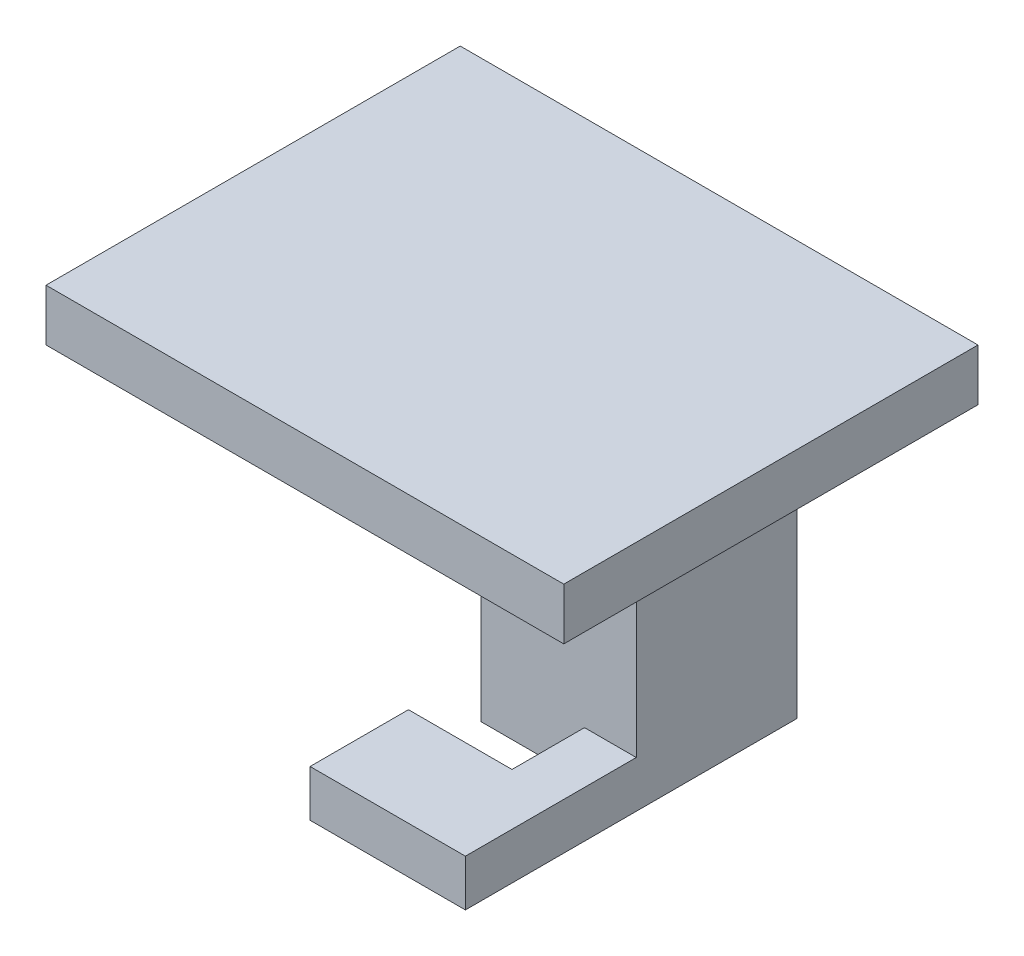
ISO-10303-21;
HEADER;
FILE_DESCRIPTION(('STEP AP214'),'2;1');
FILE_NAME('part.step','',(''),(''),'','','');
FILE_SCHEMA(('AUTOMOTIVE_DESIGN { 1 0 10303 214 1 1 1 1 }'));
ENDSEC;
DATA;
#1=APPLICATION_CONTEXT('core data for automotive mechanical design processes');
#2=APPLICATION_PROTOCOL_DEFINITION('international standard','automotive_design',2000,#1);
#3=PRODUCT_CONTEXT('',#1,'mechanical');
#4=PRODUCT('Part','Part','',(#3));
#5=PRODUCT_RELATED_PRODUCT_CATEGORY('part','',(#4));
#6=PRODUCT_DEFINITION_FORMATION('','',#4);
#7=PRODUCT_DEFINITION_CONTEXT('part definition',#1,'design');
#8=PRODUCT_DEFINITION('design','',#6,#7);
#9=PRODUCT_DEFINITION_SHAPE('','',#8);
#10=(LENGTH_UNIT() NAMED_UNIT(*) SI_UNIT(.MILLI.,.METRE.));
#11=(NAMED_UNIT(*) PLANE_ANGLE_UNIT() SI_UNIT($,.RADIAN.));
#12=(NAMED_UNIT(*) SI_UNIT($,.STERADIAN.) SOLID_ANGLE_UNIT());
#13=UNCERTAINTY_MEASURE_WITH_UNIT(LENGTH_MEASURE(1.E-05),#10,'distance_accuracy_value','');
#14=(GEOMETRIC_REPRESENTATION_CONTEXT(3) GLOBAL_UNCERTAINTY_ASSIGNED_CONTEXT((#13)) GLOBAL_UNIT_ASSIGNED_CONTEXT((#10,
#11,#12)) REPRESENTATION_CONTEXT('',''));
#15=CARTESIAN_POINT('',(0.,0.,0.));
#16=DIRECTION('',(0.,0.,1.));
#17=DIRECTION('',(1.,0.,0.));
#18=AXIS2_PLACEMENT_3D('',#15,#16,#17);
#19=CARTESIAN_POINT('',(-7.5,17.5,32.));
#20=DIRECTION('',(1.,0.,0.));
#21=DIRECTION('',(0.,1.,0.));
#22=AXIS2_PLACEMENT_3D('',#19,#20,#21);
#23=PLANE('',#22);
#24=DIRECTION('',(0.,0.,-1.));
#25=VECTOR('',#24,1.);
#26=CARTESIAN_POINT('',(-7.5,-17.5,32.));
#27=LINE('',#26,#25);
#28=CARTESIAN_POINT('',(-7.5,-17.5,15.5));
#29=VERTEX_POINT('',#28);
#30=CARTESIAN_POINT('',(-7.5,-17.5,0.));
#31=VERTEX_POINT('',#30);
#32=EDGE_CURVE('E258',#29,#31,#27,.T.);
#33=ORIENTED_EDGE('',*,*,#32,.F.);
#34=DIRECTION('',(0.,-1.,0.));
#35=VECTOR('',#34,1.);
#36=CARTESIAN_POINT('',(-7.5,0.,15.5));
#37=LINE('',#36,#35);
#38=CARTESIAN_POINT('',(-7.5,9.99999999999999,15.5));
#39=VERTEX_POINT('',#38);
#40=EDGE_CURVE('E152',#39,#29,#37,.T.);
#41=ORIENTED_EDGE('',*,*,#40,.F.);
#42=DIRECTION('',(0.,0.,1.));
#43=VECTOR('',#42,1.);
#44=CARTESIAN_POINT('',(-7.5,9.99999999999999,15.5));
#45=LINE('',#44,#43);
#46=CARTESIAN_POINT('',(-7.5,9.99999999999999,32.));
#47=VERTEX_POINT('',#46);
#48=EDGE_CURVE('E223',#39,#47,#45,.T.);
#49=ORIENTED_EDGE('',*,*,#48,.T.);
#50=DIRECTION('',(0.,-1.,0.));
#51=VECTOR('',#50,1.);
#52=CARTESIAN_POINT('',(-7.5,17.5,32.));
#53=LINE('',#52,#51);
#54=CARTESIAN_POINT('',(-7.5,17.5,32.));
#55=VERTEX_POINT('',#54);
#56=EDGE_CURVE('E233',#55,#47,#53,.T.);
#57=ORIENTED_EDGE('',*,*,#56,.F.);
#58=DIRECTION('',(0.,0.,-1.));
#59=VECTOR('',#58,1.);
#60=CARTESIAN_POINT('',(-7.5,17.5,32.));
#61=LINE('',#60,#59);
#62=CARTESIAN_POINT('',(-7.5,17.5,0.));
#63=VERTEX_POINT('',#62);
#64=EDGE_CURVE('E245',#55,#63,#61,.T.);
#65=ORIENTED_EDGE('',*,*,#64,.T.);
#66=DIRECTION('',(0.,-1.,0.));
#67=VECTOR('',#66,1.);
#68=CARTESIAN_POINT('',(-7.5,17.5,0.));
#69=LINE('',#68,#67);
#70=EDGE_CURVE('E226',#63,#31,#69,.T.);
#71=ORIENTED_EDGE('',*,*,#70,.T.);
#72=EDGE_LOOP('',(#33,#41,#49,#57,#65,#71));
#73=FACE_BOUND('',#72,.T.);
#74=ADVANCED_FACE('F37',(#73),#23,.F.);
#75=DIRECTION('',(0.,0.,1.));
#76=VECTOR('',#75,1.);
#77=CARTESIAN_POINT('',(-7.5,-13.,15.5));
#78=LINE('',#77,#76);
#79=CARTESIAN_POINT('',(-7.5,-13.,22.5));
#80=VERTEX_POINT('',#79);
#81=CARTESIAN_POINT('',(-7.5,-13.,32.));
#82=VERTEX_POINT('',#81);
#83=EDGE_CURVE('E60',#80,#82,#78,.T.);
#84=ORIENTED_EDGE('',*,*,#83,.F.);
#85=DIRECTION('',(0.,1.,0.));
#86=VECTOR('',#85,1.);
#87=CARTESIAN_POINT('',(-7.5,-17.5,22.5));
#88=LINE('',#87,#86);
#89=CARTESIAN_POINT('',(-7.5,-17.5,22.5));
#90=VERTEX_POINT('',#89);
#91=EDGE_CURVE('E162',#90,#80,#88,.T.);
#92=ORIENTED_EDGE('',*,*,#91,.F.);
#93=CARTESIAN_POINT('',(-7.5,-17.5,32.));
#94=VERTEX_POINT('',#93);
#95=EDGE_CURVE('E45',#94,#90,#27,.T.);
#96=ORIENTED_EDGE('',*,*,#95,.F.);
#97=EDGE_CURVE('E237',#82,#94,#53,.T.);
#98=ORIENTED_EDGE('',*,*,#97,.F.);
#99=EDGE_LOOP('',(#84,#92,#96,#98));
#100=FACE_BOUND('',#99,.T.);
#101=ADVANCED_FACE('F39',(#100),#23,.F.);
#102=CARTESIAN_POINT('',(7.5,17.5,32.));
#103=DIRECTION('',(-1.,0.,0.));
#104=DIRECTION('',(0.,-1.,0.));
#105=AXIS2_PLACEMENT_3D('',#102,#103,#104);
#106=PLANE('',#105);
#107=DIRECTION('',(0.,0.,1.));
#108=VECTOR('',#107,1.);
#109=CARTESIAN_POINT('',(7.5,9.99999999999999,15.5));
#110=LINE('',#109,#108);
#111=CARTESIAN_POINT('',(7.5,9.99999999999999,15.5));
#112=VERTEX_POINT('',#111);
#113=CARTESIAN_POINT('',(7.5,9.99999999999999,32.));
#114=VERTEX_POINT('',#113);
#115=EDGE_CURVE('E227',#112,#114,#110,.T.);
#116=ORIENTED_EDGE('',*,*,#115,.F.);
#117=DIRECTION('',(0.,1.,0.));
#118=VECTOR('',#117,1.);
#119=CARTESIAN_POINT('',(7.5,0.,15.5));
#120=LINE('',#119,#118);
#121=CARTESIAN_POINT('',(7.5,-13.,15.5));
#122=VERTEX_POINT('',#121);
#123=EDGE_CURVE('E215',#122,#112,#120,.T.);
#124=ORIENTED_EDGE('',*,*,#123,.F.);
#125=DIRECTION('',(0.,0.,1.));
#126=VECTOR('',#125,1.);
#127=CARTESIAN_POINT('',(7.5,-13.,15.5));
#128=LINE('',#127,#126);
#129=CARTESIAN_POINT('',(7.5,-13.,32.));
#130=VERTEX_POINT('',#129);
#131=EDGE_CURVE('E229',#122,#130,#128,.T.);
#132=ORIENTED_EDGE('',*,*,#131,.T.);
#133=DIRECTION('',(0.,1.,0.));
#134=VECTOR('',#133,1.);
#135=CARTESIAN_POINT('',(7.5,17.5,32.));
#136=LINE('',#135,#134);
#137=CARTESIAN_POINT('',(7.5,-17.5,32.));
#138=VERTEX_POINT('',#137);
#139=EDGE_CURVE('E240',#138,#130,#136,.T.);
#140=ORIENTED_EDGE('',*,*,#139,.F.);
#141=DIRECTION('',(0.,0.,-1.));
#142=VECTOR('',#141,1.);
#143=CARTESIAN_POINT('',(7.5,-17.5,32.));
#144=LINE('',#143,#142);
#145=CARTESIAN_POINT('',(7.5,-17.5,0.));
#146=VERTEX_POINT('',#145);
#147=EDGE_CURVE('E256',#138,#146,#144,.T.);
#148=ORIENTED_EDGE('',*,*,#147,.T.);
#149=DIRECTION('',(0.,1.,0.));
#150=VECTOR('',#149,1.);
#151=CARTESIAN_POINT('',(7.5,17.5,0.));
#152=LINE('',#151,#150);
#153=CARTESIAN_POINT('',(7.5,17.5,0.));
#154=VERTEX_POINT('',#153);
#155=EDGE_CURVE('E250',#146,#154,#152,.T.);
#156=ORIENTED_EDGE('',*,*,#155,.T.);
#157=DIRECTION('',(0.,0.,-1.));
#158=VECTOR('',#157,1.);
#159=CARTESIAN_POINT('',(7.5,17.5,32.));
#160=LINE('',#159,#158);
#161=CARTESIAN_POINT('',(7.5,17.5,32.));
#162=VERTEX_POINT('',#161);
#163=EDGE_CURVE('E253',#162,#154,#160,.T.);
#164=ORIENTED_EDGE('',*,*,#163,.F.);
#165=EDGE_CURVE('E239',#114,#162,#136,.T.);
#166=ORIENTED_EDGE('',*,*,#165,.F.);
#167=EDGE_LOOP('',(#116,#124,#132,#140,#148,#156,#164,#166));
#168=FACE_BOUND('',#167,.T.);
#169=ADVANCED_FACE('F293',(#168),#106,.F.);
#170=CARTESIAN_POINT('',(0.,0.,32.));
#171=DIRECTION('',(0.,0.,1.));
#172=DIRECTION('',(1.,0.,0.));
#173=AXIS2_PLACEMENT_3D('',#170,#171,#172);
#174=PLANE('',#173);
#175=ORIENTED_EDGE('',*,*,#56,.T.);
#176=DIRECTION('',(1.,0.,0.));
#177=VECTOR('',#176,1.);
#178=CARTESIAN_POINT('',(0.,9.99999999999999,32.));
#179=LINE('',#178,#177);
#180=EDGE_CURVE('E213',#47,#114,#179,.T.);
#181=ORIENTED_EDGE('',*,*,#180,.T.);
#182=ORIENTED_EDGE('',*,*,#165,.T.);
#183=DIRECTION('',(-1.,0.,0.));
#184=VECTOR('',#183,1.);
#185=CARTESIAN_POINT('',(-7.5,17.5,32.));
#186=LINE('',#185,#184);
#187=EDGE_CURVE('E243',#162,#55,#186,.T.);
#188=ORIENTED_EDGE('',*,*,#187,.T.);
#189=EDGE_LOOP('',(#175,#181,#182,#188));
#190=FACE_BOUND('',#189,.T.);
#191=ADVANCED_FACE('F307',(#190),#174,.T.);
#192=CARTESIAN_POINT('',(-7.5,-17.5,32.));
#193=DIRECTION('',(0.,1.,0.));
#194=DIRECTION('',(0.,0.,1.));
#195=AXIS2_PLACEMENT_3D('',#192,#193,#194);
#196=PLANE('',#195);
#197=DIRECTION('',(0.,0.,1.));
#198=VECTOR('',#197,1.);
#199=CARTESIAN_POINT('',(2.5,-17.5,15.5));
#200=LINE('',#199,#198);
#201=CARTESIAN_POINT('',(2.5,-17.5,15.5));
#202=VERTEX_POINT('',#201);
#203=CARTESIAN_POINT('',(2.5,-17.5,22.5));
#204=VERTEX_POINT('',#203);
#205=EDGE_CURVE('E160',#202,#204,#200,.T.);
#206=ORIENTED_EDGE('',*,*,#205,.F.);
#207=DIRECTION('',(-1.,0.,0.));
#208=VECTOR('',#207,1.);
#209=CARTESIAN_POINT('',(2.5,-17.5,15.5));
#210=LINE('',#209,#208);
#211=EDGE_CURVE('E146',#202,#29,#210,.T.);
#212=ORIENTED_EDGE('',*,*,#211,.T.);
#213=ORIENTED_EDGE('',*,*,#32,.T.);
#214=DIRECTION('',(1.,0.,0.));
#215=VECTOR('',#214,1.);
#216=CARTESIAN_POINT('',(-7.5,-17.5,0.));
#217=LINE('',#216,#215);
#218=EDGE_CURVE('E248',#31,#146,#217,.T.);
#219=ORIENTED_EDGE('',*,*,#218,.T.);
#220=ORIENTED_EDGE('',*,*,#147,.F.);
#221=DIRECTION('',(1.,0.,0.));
#222=VECTOR('',#221,1.);
#223=CARTESIAN_POINT('',(-7.5,-17.5,32.));
#224=LINE('',#223,#222);
#225=EDGE_CURVE('E236',#94,#138,#224,.T.);
#226=ORIENTED_EDGE('',*,*,#225,.F.);
#227=ORIENTED_EDGE('',*,*,#95,.T.);
#228=DIRECTION('',(-1.,0.,0.));
#229=VECTOR('',#228,1.);
#230=CARTESIAN_POINT('',(2.5,-17.5,22.5));
#231=LINE('',#230,#229);
#232=EDGE_CURVE('E156',#204,#90,#231,.T.);
#233=ORIENTED_EDGE('',*,*,#232,.F.);
#234=EDGE_LOOP('',(#206,#212,#213,#219,#220,#226,#227,#233));
#235=FACE_BOUND('',#234,.T.);
#236=ADVANCED_FACE('F164',(#235),#196,.F.);
#237=DIRECTION('',(1.,0.,0.));
#238=VECTOR('',#237,1.);
#239=CARTESIAN_POINT('',(0.,-13.,32.));
#240=LINE('',#239,#238);
#241=EDGE_CURVE('E210',#82,#130,#240,.T.);
#242=ORIENTED_EDGE('',*,*,#241,.F.);
#243=ORIENTED_EDGE('',*,*,#97,.T.);
#244=ORIENTED_EDGE('',*,*,#225,.T.);
#245=ORIENTED_EDGE('',*,*,#139,.T.);
#246=EDGE_LOOP('',(#242,#243,#244,#245));
#247=FACE_BOUND('',#246,.T.);
#248=ADVANCED_FACE('F310',(#247),#174,.T.);
#249=CARTESIAN_POINT('',(0.,0.,0.));
#250=DIRECTION('',(0.,0.,1.));
#251=DIRECTION('',(1.,0.,0.));
#252=AXIS2_PLACEMENT_3D('',#249,#250,#251);
#253=PLANE('',#252);
#254=CARTESIAN_POINT('',(0.,-6.4,0.));
#255=DIRECTION('',(0.,0.,1.));
#256=DIRECTION('',(1.,0.,0.));
#257=AXIS2_PLACEMENT_3D('',#254,#255,#256);
#258=CIRCLE('',#257,2.5);
#259=CARTESIAN_POINT('',(2.5,-6.4,0.));
#260=VERTEX_POINT('',#259);
#261=EDGE_CURVE('E11',#260,#260,#258,.F.);
#262=ORIENTED_EDGE('',*,*,#261,.F.);
#263=EDGE_LOOP('',(#262));
#264=FACE_BOUND('',#263,.T.);
#265=ORIENTED_EDGE('',*,*,#70,.F.);
#266=DIRECTION('',(-1.,0.,0.));
#267=VECTOR('',#266,1.);
#268=CARTESIAN_POINT('',(-25.,17.5,0.));
#269=LINE('',#268,#267);
#270=CARTESIAN_POINT('',(-25.,17.5,0.));
#271=VERTEX_POINT('',#270);
#272=EDGE_CURVE('E193',#63,#271,#269,.T.);
#273=ORIENTED_EDGE('',*,*,#272,.T.);
#274=DIRECTION('',(0.,-1.,0.));
#275=VECTOR('',#274,1.);
#276=CARTESIAN_POINT('',(-25.,22.5,0.));
#277=LINE('',#276,#275);
#278=CARTESIAN_POINT('',(-25.,22.5,0.));
#279=VERTEX_POINT('',#278);
#280=EDGE_CURVE('E186',#279,#271,#277,.T.);
#281=ORIENTED_EDGE('',*,*,#280,.F.);
#282=DIRECTION('',(-1.,0.,0.));
#283=VECTOR('',#282,1.);
#284=CARTESIAN_POINT('',(-25.,22.5,0.));
#285=LINE('',#284,#283);
#286=CARTESIAN_POINT('',(25.,22.5,0.));
#287=VERTEX_POINT('',#286);
#288=EDGE_CURVE('E184',#287,#279,#285,.T.);
#289=ORIENTED_EDGE('',*,*,#288,.F.);
#290=DIRECTION('',(0.,-1.,0.));
#291=VECTOR('',#290,1.);
#292=CARTESIAN_POINT('',(25.,22.5,0.));
#293=LINE('',#292,#291);
#294=CARTESIAN_POINT('',(25.,17.5,0.));
#295=VERTEX_POINT('',#294);
#296=EDGE_CURVE('E198',#287,#295,#293,.T.);
#297=ORIENTED_EDGE('',*,*,#296,.T.);
#298=EDGE_CURVE('E180',#295,#154,#269,.T.);
#299=ORIENTED_EDGE('',*,*,#298,.T.);
#300=ORIENTED_EDGE('',*,*,#155,.F.);
#301=ORIENTED_EDGE('',*,*,#218,.F.);
#302=EDGE_LOOP('',(#265,#273,#281,#289,#297,#299,#300,#301));
#303=FACE_BOUND('',#302,.T.);
#304=ADVANCED_FACE('F267',(#264,#303),#253,.F.);
#305=CARTESIAN_POINT('',(0.,9.99999999999999,15.5));
#306=DIRECTION('',(0.,-1.,0.));
#307=DIRECTION('',(0.,0.,-1.));
#308=AXIS2_PLACEMENT_3D('',#305,#306,#307);
#309=PLANE('',#308);
#310=ORIENTED_EDGE('',*,*,#180,.F.);
#311=ORIENTED_EDGE('',*,*,#48,.F.);
#312=DIRECTION('',(1.,0.,0.));
#313=VECTOR('',#312,1.);
#314=CARTESIAN_POINT('',(0.,9.99999999999999,15.5));
#315=LINE('',#314,#313);
#316=EDGE_CURVE('E218',#39,#112,#315,.T.);
#317=ORIENTED_EDGE('',*,*,#316,.T.);
#318=ORIENTED_EDGE('',*,*,#115,.T.);
#319=EDGE_LOOP('',(#310,#311,#317,#318));
#320=FACE_BOUND('',#319,.T.);
#321=ADVANCED_FACE('F305',(#320),#309,.T.);
#322=CARTESIAN_POINT('',(0.,-13.,15.5));
#323=DIRECTION('',(0.,-1.,0.));
#324=DIRECTION('',(1.,0.,0.));
#325=AXIS2_PLACEMENT_3D('',#322,#323,#324);
#326=PLANE('',#325);
#327=DIRECTION('',(0.,0.,-1.));
#328=VECTOR('',#327,1.);
#329=CARTESIAN_POINT('',(2.5,-13.,15.5));
#330=LINE('',#329,#328);
#331=CARTESIAN_POINT('',(2.5,-13.,22.5));
#332=VERTEX_POINT('',#331);
#333=CARTESIAN_POINT('',(2.5,-13.,15.5));
#334=VERTEX_POINT('',#333);
#335=EDGE_CURVE('E52',#332,#334,#330,.T.);
#336=ORIENTED_EDGE('',*,*,#335,.F.);
#337=DIRECTION('',(-1.,0.,0.));
#338=VECTOR('',#337,1.);
#339=CARTESIAN_POINT('',(2.5,-13.,22.5));
#340=LINE('',#339,#338);
#341=EDGE_CURVE('E172',#332,#80,#340,.T.);
#342=ORIENTED_EDGE('',*,*,#341,.T.);
#343=ORIENTED_EDGE('',*,*,#83,.T.);
#344=ORIENTED_EDGE('',*,*,#241,.T.);
#345=ORIENTED_EDGE('',*,*,#131,.F.);
#346=DIRECTION('',(1.,0.,0.));
#347=VECTOR('',#346,1.);
#348=CARTESIAN_POINT('',(0.,-13.,15.5));
#349=LINE('',#348,#347);
#350=EDGE_CURVE('E212',#334,#122,#349,.T.);
#351=ORIENTED_EDGE('',*,*,#350,.F.);
#352=EDGE_LOOP('',(#336,#342,#343,#344,#345,#351));
#353=FACE_BOUND('',#352,.T.);
#354=ADVANCED_FACE('F301',(#353),#326,.F.);
#355=CARTESIAN_POINT('',(0.,0.,15.5));
#356=DIRECTION('',(0.,0.,1.));
#357=DIRECTION('',(1.,0.,0.));
#358=AXIS2_PLACEMENT_3D('',#355,#356,#357);
#359=PLANE('',#358);
#360=ORIENTED_EDGE('',*,*,#40,.T.);
#361=ORIENTED_EDGE('',*,*,#211,.F.);
#362=DIRECTION('',(0.,-1.,0.));
#363=VECTOR('',#362,1.);
#364=CARTESIAN_POINT('',(2.5,-17.5,15.5));
#365=LINE('',#364,#363);
#366=EDGE_CURVE('E148',#334,#202,#365,.T.);
#367=ORIENTED_EDGE('',*,*,#366,.F.);
#368=ORIENTED_EDGE('',*,*,#350,.T.);
#369=ORIENTED_EDGE('',*,*,#123,.T.);
#370=ORIENTED_EDGE('',*,*,#316,.F.);
#371=EDGE_LOOP('',(#360,#361,#367,#368,#369,#370));
#372=FACE_BOUND('',#371,.T.);
#373=ADVANCED_FACE('F147',(#372),#359,.T.);
#374=CARTESIAN_POINT('',(0.,-6.4,-3.));
#375=DIRECTION('',(0.,0.,1.));
#376=DIRECTION('',(1.,0.,0.));
#377=AXIS2_PLACEMENT_3D('',#374,#375,#376);
#378=CYLINDRICAL_SURFACE('',#377,2.5);
#379=CARTESIAN_POINT('',(0.,-6.4,-3.));
#380=DIRECTION('',(0.,0.,-1.));
#381=DIRECTION('',(-1.,0.,0.));
#382=AXIS2_PLACEMENT_3D('',#379,#380,#381);
#383=CIRCLE('',#382,2.5);
#384=CARTESIAN_POINT('',(-2.5,-6.4,-3.));
#385=VERTEX_POINT('',#384);
#386=EDGE_CURVE('E207',#385,#385,#383,.T.);
#387=ORIENTED_EDGE('',*,*,#386,.F.);
#388=EDGE_LOOP('',(#387));
#389=FACE_BOUND('',#388,.T.);
#390=ORIENTED_EDGE('',*,*,#261,.T.);
#391=EDGE_LOOP('',(#390));
#392=FACE_BOUND('',#391,.T.);
#393=ADVANCED_FACE('F409',(#389,#392),#378,.T.);
#394=CARTESIAN_POINT('',(0.,-6.4,-3.));
#395=DIRECTION('',(0.,0.,-1.));
#396=DIRECTION('',(-1.,0.,0.));
#397=AXIS2_PLACEMENT_3D('',#394,#395,#396);
#398=PLANE('',#397);
#399=ORIENTED_EDGE('',*,*,#386,.T.);
#400=EDGE_LOOP('',(#399));
#401=FACE_BOUND('',#400,.T.);
#402=ADVANCED_FACE('F336',(#401),#398,.T.);
#403=CARTESIAN_POINT('',(-25.,22.5,0.));
#404=DIRECTION('',(1.,0.,0.));
#405=DIRECTION('',(0.,0.,-1.));
#406=AXIS2_PLACEMENT_3D('',#403,#404,#405);
#407=PLANE('',#406);
#408=DIRECTION('',(0.,0.,1.));
#409=VECTOR('',#408,1.);
#410=CARTESIAN_POINT('',(-25.,17.5,0.));
#411=LINE('',#410,#409);
#412=CARTESIAN_POINT('',(-25.,17.5,40.));
#413=VERTEX_POINT('',#412);
#414=EDGE_CURVE('E174',#271,#413,#411,.T.);
#415=ORIENTED_EDGE('',*,*,#414,.T.);
#416=DIRECTION('',(0.,-1.,0.));
#417=VECTOR('',#416,1.);
#418=CARTESIAN_POINT('',(-25.,22.5,40.));
#419=LINE('',#418,#417);
#420=CARTESIAN_POINT('',(-25.,22.5,40.));
#421=VERTEX_POINT('',#420);
#422=EDGE_CURVE('E204',#421,#413,#419,.T.);
#423=ORIENTED_EDGE('',*,*,#422,.F.);
#424=DIRECTION('',(0.,0.,1.));
#425=VECTOR('',#424,1.);
#426=CARTESIAN_POINT('',(-25.,22.5,0.));
#427=LINE('',#426,#425);
#428=EDGE_CURVE('E176',#279,#421,#427,.T.);
#429=ORIENTED_EDGE('',*,*,#428,.F.);
#430=ORIENTED_EDGE('',*,*,#280,.T.);
#431=EDGE_LOOP('',(#415,#423,#429,#430));
#432=FACE_BOUND('',#431,.T.);
#433=ADVANCED_FACE('F279',(#432),#407,.F.);
#434=CARTESIAN_POINT('',(-25.,22.5,40.));
#435=DIRECTION('',(0.,0.,-1.));
#436=DIRECTION('',(-1.,0.,0.));
#437=AXIS2_PLACEMENT_3D('',#434,#435,#436);
#438=PLANE('',#437);
#439=DIRECTION('',(1.,0.,0.));
#440=VECTOR('',#439,1.);
#441=CARTESIAN_POINT('',(-25.,17.5,40.));
#442=LINE('',#441,#440);
#443=CARTESIAN_POINT('',(25.,17.5,40.));
#444=VERTEX_POINT('',#443);
#445=EDGE_CURVE('E189',#413,#444,#442,.T.);
#446=ORIENTED_EDGE('',*,*,#445,.T.);
#447=DIRECTION('',(0.,-1.,0.));
#448=VECTOR('',#447,1.);
#449=CARTESIAN_POINT('',(25.,22.5,40.));
#450=LINE('',#449,#448);
#451=CARTESIAN_POINT('',(25.,22.5,40.));
#452=VERTEX_POINT('',#451);
#453=EDGE_CURVE('E201',#452,#444,#450,.T.);
#454=ORIENTED_EDGE('',*,*,#453,.F.);
#455=DIRECTION('',(1.,0.,0.));
#456=VECTOR('',#455,1.);
#457=CARTESIAN_POINT('',(-25.,22.5,40.));
#458=LINE('',#457,#456);
#459=EDGE_CURVE('E179',#421,#452,#458,.T.);
#460=ORIENTED_EDGE('',*,*,#459,.F.);
#461=ORIENTED_EDGE('',*,*,#422,.T.);
#462=EDGE_LOOP('',(#446,#454,#460,#461));
#463=FACE_BOUND('',#462,.T.);
#464=ADVANCED_FACE('F359',(#463),#438,.F.);
#465=CARTESIAN_POINT('',(25.,22.5,0.));
#466=DIRECTION('',(-1.,0.,0.));
#467=DIRECTION('',(0.,0.,1.));
#468=AXIS2_PLACEMENT_3D('',#465,#466,#467);
#469=PLANE('',#468);
#470=DIRECTION('',(0.,0.,-1.));
#471=VECTOR('',#470,1.);
#472=CARTESIAN_POINT('',(25.,17.5,0.));
#473=LINE('',#472,#471);
#474=EDGE_CURVE('E191',#444,#295,#473,.T.);
#475=ORIENTED_EDGE('',*,*,#474,.T.);
#476=ORIENTED_EDGE('',*,*,#296,.F.);
#477=DIRECTION('',(0.,0.,-1.));
#478=VECTOR('',#477,1.);
#479=CARTESIAN_POINT('',(25.,22.5,0.));
#480=LINE('',#479,#478);
#481=EDGE_CURVE('E182',#452,#287,#480,.T.);
#482=ORIENTED_EDGE('',*,*,#481,.F.);
#483=ORIENTED_EDGE('',*,*,#453,.T.);
#484=EDGE_LOOP('',(#475,#476,#482,#483));
#485=FACE_BOUND('',#484,.T.);
#486=ADVANCED_FACE('F368',(#485),#469,.F.);
#487=CARTESIAN_POINT('',(0.,22.5,0.));
#488=DIRECTION('',(0.,1.,0.));
#489=DIRECTION('',(0.,0.,1.));
#490=AXIS2_PLACEMENT_3D('',#487,#488,#489);
#491=PLANE('',#490);
#492=ORIENTED_EDGE('',*,*,#428,.T.);
#493=ORIENTED_EDGE('',*,*,#459,.T.);
#494=ORIENTED_EDGE('',*,*,#481,.T.);
#495=ORIENTED_EDGE('',*,*,#288,.T.);
#496=EDGE_LOOP('',(#492,#493,#494,#495));
#497=FACE_BOUND('',#496,.T.);
#498=ADVANCED_FACE('F282',(#497),#491,.T.);
#499=CARTESIAN_POINT('',(0.,17.5,0.));
#500=DIRECTION('',(0.,1.,0.));
#501=DIRECTION('',(0.,0.,1.));
#502=AXIS2_PLACEMENT_3D('',#499,#500,#501);
#503=PLANE('',#502);
#504=ORIENTED_EDGE('',*,*,#64,.F.);
#505=ORIENTED_EDGE('',*,*,#187,.F.);
#506=ORIENTED_EDGE('',*,*,#163,.T.);
#507=ORIENTED_EDGE('',*,*,#298,.F.);
#508=ORIENTED_EDGE('',*,*,#474,.F.);
#509=ORIENTED_EDGE('',*,*,#445,.F.);
#510=ORIENTED_EDGE('',*,*,#414,.F.);
#511=ORIENTED_EDGE('',*,*,#272,.F.);
#512=EDGE_LOOP('',(#504,#505,#506,#507,#508,#509,#510,#511));
#513=FACE_BOUND('',#512,.T.);
#514=ADVANCED_FACE('F273',(#513),#503,.F.);
#515=CARTESIAN_POINT('',(2.5,-17.5,22.5));
#516=DIRECTION('',(0.,0.,1.));
#517=DIRECTION('',(1.,0.,0.));
#518=AXIS2_PLACEMENT_3D('',#515,#516,#517);
#519=PLANE('',#518);
#520=ORIENTED_EDGE('',*,*,#91,.T.);
#521=ORIENTED_EDGE('',*,*,#341,.F.);
#522=DIRECTION('',(0.,1.,0.));
#523=VECTOR('',#522,1.);
#524=CARTESIAN_POINT('',(2.5,-17.5,22.5));
#525=LINE('',#524,#523);
#526=EDGE_CURVE('E166',#204,#332,#525,.T.);
#527=ORIENTED_EDGE('',*,*,#526,.F.);
#528=ORIENTED_EDGE('',*,*,#232,.T.);
#529=EDGE_LOOP('',(#520,#521,#527,#528));
#530=FACE_BOUND('',#529,.T.);
#531=ADVANCED_FACE('F300',(#530),#519,.F.);
#532=CARTESIAN_POINT('',(2.5,0.,0.));
#533=DIRECTION('',(1.,0.,0.));
#534=DIRECTION('',(0.,1.,0.));
#535=AXIS2_PLACEMENT_3D('',#532,#533,#534);
#536=PLANE('',#535);
#537=ORIENTED_EDGE('',*,*,#366,.T.);
#538=ORIENTED_EDGE('',*,*,#205,.T.);
#539=ORIENTED_EDGE('',*,*,#526,.T.);
#540=ORIENTED_EDGE('',*,*,#335,.T.);
#541=EDGE_LOOP('',(#537,#538,#539,#540));
#542=FACE_BOUND('',#541,.T.);
#543=ADVANCED_FACE('F159',(#542),#536,.F.);
#544=CLOSED_SHELL('',(#74,#101,#169,#191,#236,#248,#304,#321,#354,#373,#393,#402,#433,#464,#486,
#498,#514,#531,#543));
#545=MANIFOLD_SOLID_BREP('B2',#544);
#546=ADVANCED_BREP_SHAPE_REPRESENTATION('',(#18,#545),#14);
#547=SHAPE_DEFINITION_REPRESENTATION(#9,#546);
ENDSEC;
END-ISO-10303-21;
